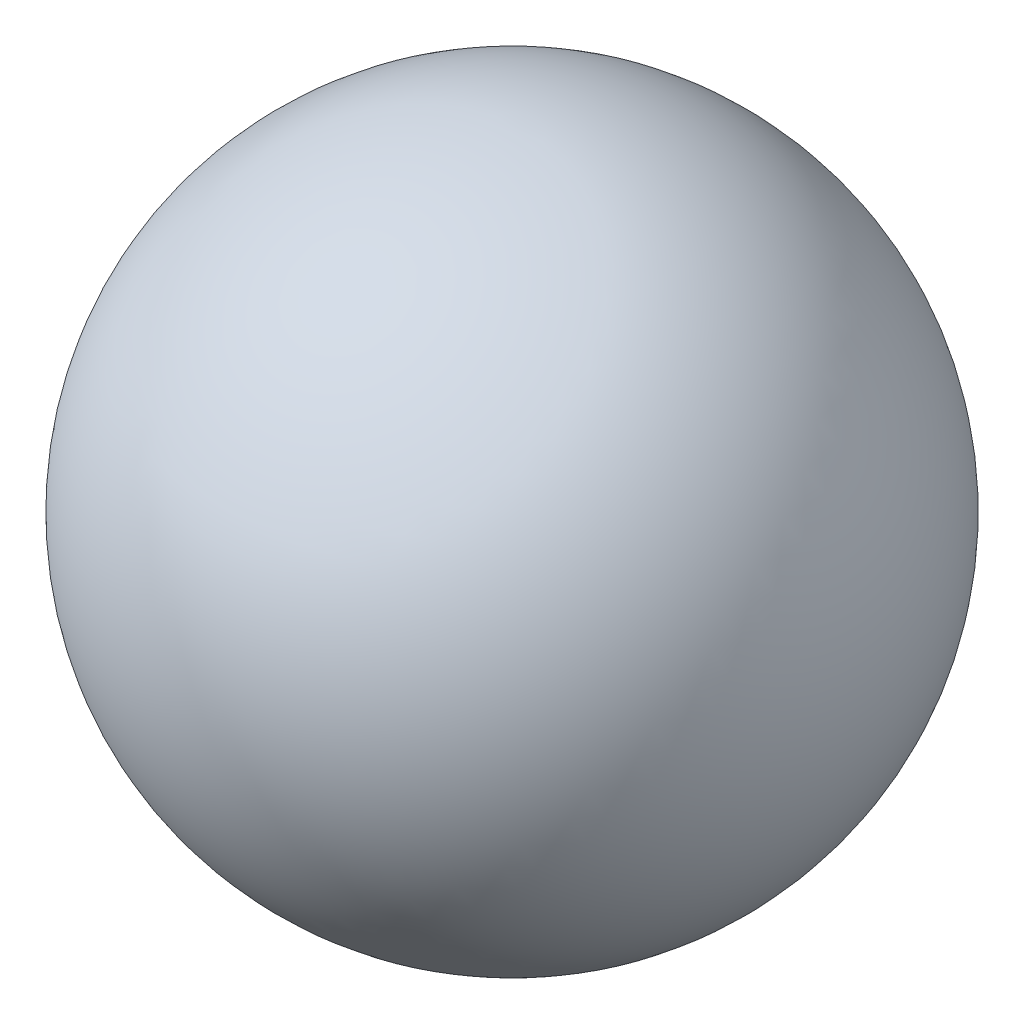
ISO-10303-21;
HEADER;
FILE_DESCRIPTION(('STEP AP214'),'2;1');
FILE_NAME('part.step','',(''),(''),'','','');
FILE_SCHEMA(('AUTOMOTIVE_DESIGN { 1 0 10303 214 1 1 1 1 }'));
ENDSEC;
DATA;
#1=APPLICATION_CONTEXT('core data for automotive mechanical design processes');
#2=APPLICATION_PROTOCOL_DEFINITION('international standard','automotive_design',2000,#1);
#3=PRODUCT_CONTEXT('',#1,'mechanical');
#4=PRODUCT('Part','Part','',(#3));
#5=PRODUCT_RELATED_PRODUCT_CATEGORY('part','',(#4));
#6=PRODUCT_DEFINITION_FORMATION('','',#4);
#7=PRODUCT_DEFINITION_CONTEXT('part definition',#1,'design');
#8=PRODUCT_DEFINITION('design','',#6,#7);
#9=PRODUCT_DEFINITION_SHAPE('','',#8);
#10=(LENGTH_UNIT() NAMED_UNIT(*) SI_UNIT(.MILLI.,.METRE.));
#11=(NAMED_UNIT(*) PLANE_ANGLE_UNIT() SI_UNIT($,.RADIAN.));
#12=(NAMED_UNIT(*) SI_UNIT($,.STERADIAN.) SOLID_ANGLE_UNIT());
#13=UNCERTAINTY_MEASURE_WITH_UNIT(LENGTH_MEASURE(1.E-05),#10,'distance_accuracy_value','');
#14=(GEOMETRIC_REPRESENTATION_CONTEXT(3) GLOBAL_UNCERTAINTY_ASSIGNED_CONTEXT((#13)) GLOBAL_UNIT_ASSIGNED_CONTEXT((#10,
#11,#12)) REPRESENTATION_CONTEXT('',''));
#15=CARTESIAN_POINT('',(0.,0.,0.));
#16=DIRECTION('',(0.,0.,1.));
#17=DIRECTION('',(1.,0.,0.));
#18=AXIS2_PLACEMENT_3D('',#15,#16,#17);
#19=CARTESIAN_POINT('',(0.,0.,0.));
#20=DIRECTION('',(0.,1.,0.));
#21=DIRECTION('',(1.,0.,0.));
#22=AXIS2_PLACEMENT_3D('',#19,#20,#21);
#23=SPHERICAL_SURFACE('',#22,12.);
#24=CARTESIAN_POINT('',(0.,12.,0.));
#25=VERTEX_POINT('',#24);
#26=VERTEX_LOOP('',#25);
#27=FACE_BOUND('',#26,.T.);
#28=ADVANCED_FACE('F35',(#27),#23,.T.);
#29=CLOSED_SHELL('',(#28));
#30=MANIFOLD_SOLID_BREP('B2',#29);
#31=ADVANCED_BREP_SHAPE_REPRESENTATION('',(#18,#30),#14);
#32=SHAPE_DEFINITION_REPRESENTATION(#9,#31);
ENDSEC;
END-ISO-10303-21;
